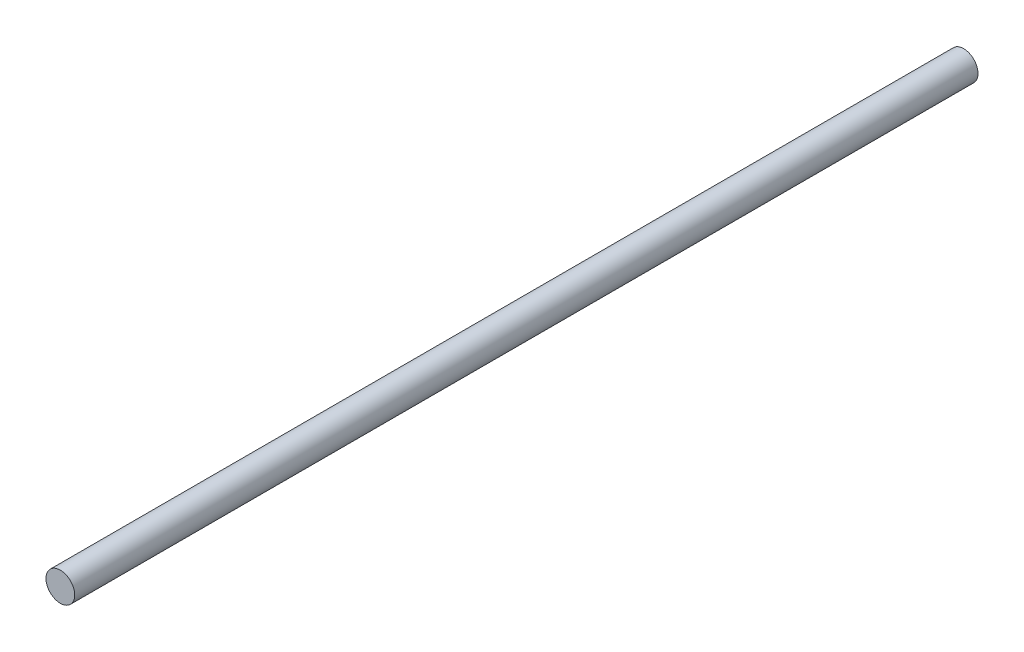
ISO-10303-21;
HEADER;
FILE_DESCRIPTION(('STEP AP214'),'2;1');
FILE_NAME('part.step','',(''),(''),'','','');
FILE_SCHEMA(('AUTOMOTIVE_DESIGN { 1 0 10303 214 1 1 1 1 }'));
ENDSEC;
DATA;
#1=APPLICATION_CONTEXT('core data for automotive mechanical design processes');
#2=APPLICATION_PROTOCOL_DEFINITION('international standard','automotive_design',2000,#1);
#3=PRODUCT_CONTEXT('',#1,'mechanical');
#4=PRODUCT('Part','Part','',(#3));
#5=PRODUCT_RELATED_PRODUCT_CATEGORY('part','',(#4));
#6=PRODUCT_DEFINITION_FORMATION('','',#4);
#7=PRODUCT_DEFINITION_CONTEXT('part definition',#1,'design');
#8=PRODUCT_DEFINITION('design','',#6,#7);
#9=PRODUCT_DEFINITION_SHAPE('','',#8);
#10=(LENGTH_UNIT() NAMED_UNIT(*) SI_UNIT(.MILLI.,.METRE.));
#11=(NAMED_UNIT(*) PLANE_ANGLE_UNIT() SI_UNIT($,.RADIAN.));
#12=(NAMED_UNIT(*) SI_UNIT($,.STERADIAN.) SOLID_ANGLE_UNIT());
#13=UNCERTAINTY_MEASURE_WITH_UNIT(LENGTH_MEASURE(1.E-05),#10,'distance_accuracy_value','');
#14=(GEOMETRIC_REPRESENTATION_CONTEXT(3) GLOBAL_UNCERTAINTY_ASSIGNED_CONTEXT((#13)) GLOBAL_UNIT_ASSIGNED_CONTEXT((#10,
#11,#12)) REPRESENTATION_CONTEXT('',''));
#15=CARTESIAN_POINT('',(0.,0.,0.));
#16=DIRECTION('',(0.,0.,1.));
#17=DIRECTION('',(1.,0.,0.));
#18=AXIS2_PLACEMENT_3D('',#15,#16,#17);
#19=CARTESIAN_POINT('',(0.,-0.5,-22.));
#20=DIRECTION('',(0.,0.,1.));
#21=DIRECTION('',(1.,0.,0.));
#22=AXIS2_PLACEMENT_3D('',#19,#20,#21);
#23=PLANE('',#22);
#24=CARTESIAN_POINT('',(0.,-0.5,-22.));
#25=DIRECTION('',(0.,0.,1.));
#26=DIRECTION('',(1.,0.,0.));
#27=AXIS2_PLACEMENT_3D('',#24,#25,#26);
#28=CIRCLE('',#27,0.35);
#29=CARTESIAN_POINT('',(0.35,-0.5,-22.));
#30=VERTEX_POINT('',#29);
#31=EDGE_CURVE('E17',#30,#30,#28,.T.);
#32=ORIENTED_EDGE('',*,*,#31,.F.);
#33=EDGE_LOOP('',(#32));
#34=FACE_BOUND('',#33,.T.);
#35=ADVANCED_FACE('F14',(#34),#23,.F.);
#36=CARTESIAN_POINT('',(0.,-0.5,0.));
#37=DIRECTION('',(0.,0.,1.));
#38=DIRECTION('',(1.,0.,0.));
#39=AXIS2_PLACEMENT_3D('',#36,#37,#38);
#40=PLANE('',#39);
#41=CARTESIAN_POINT('',(0.,-0.5,0.));
#42=DIRECTION('',(0.,0.,1.));
#43=DIRECTION('',(1.,0.,0.));
#44=AXIS2_PLACEMENT_3D('',#41,#42,#43);
#45=CIRCLE('',#44,0.35);
#46=CARTESIAN_POINT('',(0.35,-0.5,0.));
#47=VERTEX_POINT('',#46);
#48=EDGE_CURVE('E9',#47,#47,#45,.F.);
#49=ORIENTED_EDGE('',*,*,#48,.F.);
#50=EDGE_LOOP('',(#49));
#51=FACE_BOUND('',#50,.T.);
#52=ADVANCED_FACE('F29',(#51),#40,.T.);
#53=CARTESIAN_POINT('',(0.,-0.5,0.));
#54=DIRECTION('',(0.,0.,1.));
#55=DIRECTION('',(1.,0.,0.));
#56=AXIS2_PLACEMENT_3D('',#53,#54,#55);
#57=CYLINDRICAL_SURFACE('',#56,0.35);
#58=ORIENTED_EDGE('',*,*,#31,.T.);
#59=EDGE_LOOP('',(#58));
#60=FACE_BOUND('',#59,.T.);
#61=ORIENTED_EDGE('',*,*,#48,.T.);
#62=EDGE_LOOP('',(#61));
#63=FACE_BOUND('',#62,.T.);
#64=ADVANCED_FACE('F26',(#60,#63),#57,.T.);
#65=CLOSED_SHELL('',(#35,#52,#64));
#66=MANIFOLD_SOLID_BREP('B1',#65);
#67=ADVANCED_BREP_SHAPE_REPRESENTATION('',(#18,#66),#14);
#68=SHAPE_DEFINITION_REPRESENTATION(#9,#67);
ENDSEC;
END-ISO-10303-21;
